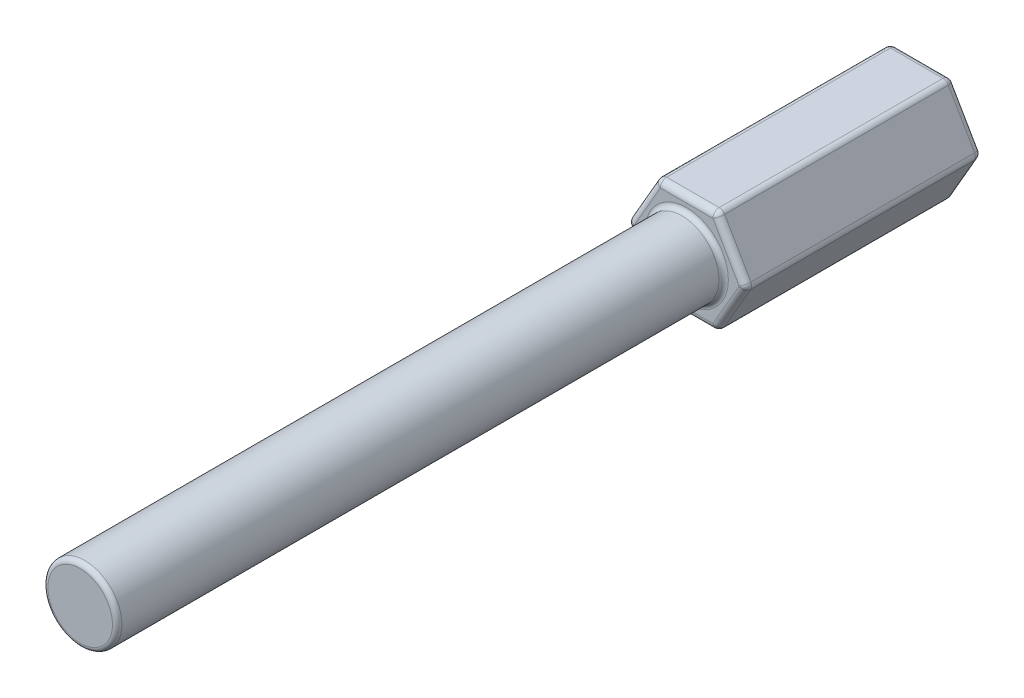
ISO-10303-21;
HEADER;
FILE_DESCRIPTION(('STEP AP214'),'2;1');
FILE_NAME('part.step','',(''),(''),'','','');
FILE_SCHEMA(('AUTOMOTIVE_DESIGN { 1 0 10303 214 1 1 1 1 }'));
ENDSEC;
DATA;
#1=APPLICATION_CONTEXT('core data for automotive mechanical design processes');
#2=APPLICATION_PROTOCOL_DEFINITION('international standard','automotive_design',2000,#1);
#3=PRODUCT_CONTEXT('',#1,'mechanical');
#4=PRODUCT('Part','Part','',(#3));
#5=PRODUCT_RELATED_PRODUCT_CATEGORY('part','',(#4));
#6=PRODUCT_DEFINITION_FORMATION('','',#4);
#7=PRODUCT_DEFINITION_CONTEXT('part definition',#1,'design');
#8=PRODUCT_DEFINITION('design','',#6,#7);
#9=PRODUCT_DEFINITION_SHAPE('','',#8);
#10=(LENGTH_UNIT() NAMED_UNIT(*) SI_UNIT(.MILLI.,.METRE.));
#11=(NAMED_UNIT(*) PLANE_ANGLE_UNIT() SI_UNIT($,.RADIAN.));
#12=(NAMED_UNIT(*) SI_UNIT($,.STERADIAN.) SOLID_ANGLE_UNIT());
#13=UNCERTAINTY_MEASURE_WITH_UNIT(LENGTH_MEASURE(1.E-05),#10,'distance_accuracy_value','');
#14=(GEOMETRIC_REPRESENTATION_CONTEXT(3) GLOBAL_UNCERTAINTY_ASSIGNED_CONTEXT((#13)) GLOBAL_UNIT_ASSIGNED_CONTEXT((#10,
#11,#12)) REPRESENTATION_CONTEXT('',''));
#15=CARTESIAN_POINT('',(0.,0.,0.));
#16=DIRECTION('',(0.,0.,1.));
#17=DIRECTION('',(1.,0.,0.));
#18=AXIS2_PLACEMENT_3D('',#15,#16,#17);
#19=CARTESIAN_POINT('',(-2.41050954265034,-4.175125,19.05));
#20=DIRECTION('',(0.,1.,0.));
#21=DIRECTION('',(-1.,0.,0.));
#22=AXIS2_PLACEMENT_3D('',#19,#20,#21);
#23=PLANE('',#22);
#24=DIRECTION('',(1.,0.,0.));
#25=VECTOR('',#24,1.);
#26=CARTESIAN_POINT('',(-2.41050954265034,-4.175125,0.508000000000002));
#27=LINE('',#26,#25);
#28=CARTESIAN_POINT('',(-2.11721560590201,-4.175125,0.508000000000002));
#29=VERTEX_POINT('',#28);
#30=CARTESIAN_POINT('',(2.11721560590201,-4.175125,0.508000000000002));
#31=VERTEX_POINT('',#30);
#32=EDGE_CURVE('E405',#29,#31,#27,.T.);
#33=ORIENTED_EDGE('',*,*,#32,.T.);
#34=DIRECTION('',(0.,0.,-1.));
#35=VECTOR('',#34,1.);
#36=CARTESIAN_POINT('',(2.11721560590201,-4.175125,19.05));
#37=LINE('',#36,#35);
#38=CARTESIAN_POINT('',(2.11721560590201,-4.175125,18.542));
#39=VERTEX_POINT('',#38);
#40=EDGE_CURVE('E219',#31,#39,#37,.F.);
#41=ORIENTED_EDGE('',*,*,#40,.T.);
#42=DIRECTION('',(1.,0.,0.));
#43=VECTOR('',#42,1.);
#44=CARTESIAN_POINT('',(-2.41050954265034,-4.175125,18.542));
#45=LINE('',#44,#43);
#46=CARTESIAN_POINT('',(-2.11721560590201,-4.175125,18.542));
#47=VERTEX_POINT('',#46);
#48=EDGE_CURVE('E363',#39,#47,#45,.F.);
#49=ORIENTED_EDGE('',*,*,#48,.T.);
#50=DIRECTION('',(0.,0.,-1.));
#51=VECTOR('',#50,1.);
#52=CARTESIAN_POINT('',(-2.11721560590201,-4.175125,19.05));
#53=LINE('',#52,#51);
#54=EDGE_CURVE('E217',#47,#29,#53,.T.);
#55=ORIENTED_EDGE('',*,*,#54,.T.);
#56=EDGE_LOOP('',(#33,#41,#49,#55));
#57=FACE_BOUND('',#56,.T.);
#58=ADVANCED_FACE('F38',(#57),#23,.F.);
#59=CARTESIAN_POINT('',(2.41050954265034,-4.175125,19.05));
#60=DIRECTION('',(-0.866025403784439,0.5,0.));
#61=DIRECTION('',(-0.5,-0.866025403784439,0.));
#62=AXIS2_PLACEMENT_3D('',#59,#60,#61);
#63=PLANE('',#62);
#64=DIRECTION('',(0.5,0.866025403784439,0.));
#65=VECTOR('',#64,1.);
#66=CARTESIAN_POINT('',(2.41050954265034,-4.175125,0.508000000000002));
#67=LINE('',#66,#65);
#68=CARTESIAN_POINT('',(2.5571565110245,-3.921125,0.508000000000002));
#69=VERTEX_POINT('',#68);
#70=CARTESIAN_POINT('',(4.67437211692651,-0.253999999999999,0.508000000000002));
#71=VERTEX_POINT('',#70);
#72=EDGE_CURVE('E195',#69,#71,#67,.T.);
#73=ORIENTED_EDGE('',*,*,#72,.T.);
#74=DIRECTION('',(0.,0.,-1.));
#75=VECTOR('',#74,1.);
#76=CARTESIAN_POINT('',(4.67437211692651,-0.254,19.05));
#77=LINE('',#76,#75);
#78=CARTESIAN_POINT('',(4.67437211692651,-0.253999999999999,18.542));
#79=VERTEX_POINT('',#78);
#80=EDGE_CURVE('E215',#71,#79,#77,.F.);
#81=ORIENTED_EDGE('',*,*,#80,.T.);
#82=DIRECTION('',(0.5,0.866025403784439,0.));
#83=VECTOR('',#82,1.);
#84=CARTESIAN_POINT('',(2.41050954265034,-4.175125,18.542));
#85=LINE('',#84,#83);
#86=CARTESIAN_POINT('',(2.5571565110245,-3.921125,18.542));
#87=VERTEX_POINT('',#86);
#88=EDGE_CURVE('E380',#79,#87,#85,.F.);
#89=ORIENTED_EDGE('',*,*,#88,.T.);
#90=DIRECTION('',(0.,0.,-1.));
#91=VECTOR('',#90,1.);
#92=CARTESIAN_POINT('',(2.5571565110245,-3.921125,19.05));
#93=LINE('',#92,#91);
#94=EDGE_CURVE('E213',#87,#69,#93,.T.);
#95=ORIENTED_EDGE('',*,*,#94,.T.);
#96=EDGE_LOOP('',(#73,#81,#89,#95));
#97=FACE_BOUND('',#96,.T.);
#98=ADVANCED_FACE('F382',(#97),#63,.F.);
#99=CARTESIAN_POINT('',(4.82101908530067,0.,19.05));
#100=DIRECTION('',(-0.866025403784439,-0.5,0.));
#101=DIRECTION('',(0.5,-0.866025403784439,0.));
#102=AXIS2_PLACEMENT_3D('',#99,#100,#101);
#103=PLANE('',#102);
#104=DIRECTION('',(-0.5,0.866025403784439,0.));
#105=VECTOR('',#104,1.);
#106=CARTESIAN_POINT('',(4.82101908530067,0.,0.508000000000002));
#107=LINE('',#106,#105);
#108=CARTESIAN_POINT('',(4.67437211692651,0.254,0.508000000000002));
#109=VERTEX_POINT('',#108);
#110=CARTESIAN_POINT('',(2.5571565110245,3.921125,0.508000000000002));
#111=VERTEX_POINT('',#110);
#112=EDGE_CURVE('E401',#109,#111,#107,.T.);
#113=ORIENTED_EDGE('',*,*,#112,.T.);
#114=DIRECTION('',(0.,0.,-1.));
#115=VECTOR('',#114,1.);
#116=CARTESIAN_POINT('',(2.5571565110245,3.921125,19.05));
#117=LINE('',#116,#115);
#118=CARTESIAN_POINT('',(2.5571565110245,3.921125,18.542));
#119=VERTEX_POINT('',#118);
#120=EDGE_CURVE('E211',#111,#119,#117,.F.);
#121=ORIENTED_EDGE('',*,*,#120,.T.);
#122=DIRECTION('',(-0.5,0.866025403784439,0.));
#123=VECTOR('',#122,1.);
#124=CARTESIAN_POINT('',(4.82101908530067,0.,18.542));
#125=LINE('',#124,#123);
#126=CARTESIAN_POINT('',(4.67437211692651,0.254,18.542));
#127=VERTEX_POINT('',#126);
#128=EDGE_CURVE('E398',#119,#127,#125,.F.);
#129=ORIENTED_EDGE('',*,*,#128,.T.);
#130=DIRECTION('',(0.,0.,-1.));
#131=VECTOR('',#130,1.);
#132=CARTESIAN_POINT('',(4.67437211692651,0.254,19.05));
#133=LINE('',#132,#131);
#134=EDGE_CURVE('E209',#127,#109,#133,.T.);
#135=ORIENTED_EDGE('',*,*,#134,.T.);
#136=EDGE_LOOP('',(#113,#121,#129,#135));
#137=FACE_BOUND('',#136,.T.);
#138=ADVANCED_FACE('F449',(#137),#103,.F.);
#139=CARTESIAN_POINT('',(2.41050954265034,4.175125,19.05));
#140=DIRECTION('',(0.,-1.,0.));
#141=DIRECTION('',(1.,0.,0.));
#142=AXIS2_PLACEMENT_3D('',#139,#140,#141);
#143=PLANE('',#142);
#144=DIRECTION('',(-1.,0.,0.));
#145=VECTOR('',#144,1.);
#146=CARTESIAN_POINT('',(2.41050954265034,4.175125,18.542));
#147=LINE('',#146,#145);
#148=CARTESIAN_POINT('',(-2.11721560590201,4.175125,18.542));
#149=VERTEX_POINT('',#148);
#150=CARTESIAN_POINT('',(2.11721560590201,4.175125,18.542));
#151=VERTEX_POINT('',#150);
#152=EDGE_CURVE('E408',#149,#151,#147,.F.);
#153=ORIENTED_EDGE('',*,*,#152,.T.);
#154=DIRECTION('',(0.,0.,-1.));
#155=VECTOR('',#154,1.);
#156=CARTESIAN_POINT('',(2.11721560590201,4.175125,19.05));
#157=LINE('',#156,#155);
#158=CARTESIAN_POINT('',(2.11721560590201,4.175125,0.508000000000002));
#159=VERTEX_POINT('',#158);
#160=EDGE_CURVE('E207',#151,#159,#157,.T.);
#161=ORIENTED_EDGE('',*,*,#160,.T.);
#162=DIRECTION('',(-1.,0.,0.));
#163=VECTOR('',#162,1.);
#164=CARTESIAN_POINT('',(2.41050954265034,4.175125,0.508000000000002));
#165=LINE('',#164,#163);
#166=CARTESIAN_POINT('',(-2.11721560590201,4.175125,0.508000000000002));
#167=VERTEX_POINT('',#166);
#168=EDGE_CURVE('E411',#159,#167,#165,.T.);
#169=ORIENTED_EDGE('',*,*,#168,.T.);
#170=DIRECTION('',(0.,0.,-1.));
#171=VECTOR('',#170,1.);
#172=CARTESIAN_POINT('',(-2.11721560590201,4.175125,19.05));
#173=LINE('',#172,#171);
#174=EDGE_CURVE('E200',#167,#149,#173,.F.);
#175=ORIENTED_EDGE('',*,*,#174,.T.);
#176=EDGE_LOOP('',(#153,#161,#169,#175));
#177=FACE_BOUND('',#176,.T.);
#178=ADVANCED_FACE('F416',(#177),#143,.F.);
#179=CARTESIAN_POINT('',(-2.41050954265034,4.175125,19.05));
#180=DIRECTION('',(0.866025403784439,-0.5,0.));
#181=DIRECTION('',(0.5,0.866025403784439,0.));
#182=AXIS2_PLACEMENT_3D('',#179,#180,#181);
#183=PLANE('',#182);
#184=DIRECTION('',(-0.5,-0.866025403784439,0.));
#185=VECTOR('',#184,1.);
#186=CARTESIAN_POINT('',(-2.41050954265034,4.175125,18.542));
#187=LINE('',#186,#185);
#188=CARTESIAN_POINT('',(-4.67437211692651,0.254000000000002,18.542));
#189=VERTEX_POINT('',#188);
#190=CARTESIAN_POINT('',(-2.5571565110245,3.921125,18.542));
#191=VERTEX_POINT('',#190);
#192=EDGE_CURVE('E263',#189,#191,#187,.F.);
#193=ORIENTED_EDGE('',*,*,#192,.T.);
#194=DIRECTION('',(0.,0.,-1.));
#195=VECTOR('',#194,1.);
#196=CARTESIAN_POINT('',(-2.5571565110245,3.921125,19.05));
#197=LINE('',#196,#195);
#198=CARTESIAN_POINT('',(-2.5571565110245,3.921125,0.508000000000002));
#199=VERTEX_POINT('',#198);
#200=EDGE_CURVE('E11',#191,#199,#197,.T.);
#201=ORIENTED_EDGE('',*,*,#200,.T.);
#202=DIRECTION('',(-0.5,-0.866025403784439,0.));
#203=VECTOR('',#202,1.);
#204=CARTESIAN_POINT('',(-2.41050954265034,4.175125,0.508000000000002));
#205=LINE('',#204,#203);
#206=CARTESIAN_POINT('',(-4.67437211692651,0.254000000000002,0.508000000000002));
#207=VERTEX_POINT('',#206);
#208=EDGE_CURVE('E264',#199,#207,#205,.T.);
#209=ORIENTED_EDGE('',*,*,#208,.T.);
#210=DIRECTION('',(0.,0.,-1.));
#211=VECTOR('',#210,1.);
#212=CARTESIAN_POINT('',(-4.67437211692651,0.254000000000002,19.05));
#213=LINE('',#212,#211);
#214=EDGE_CURVE('E47',#207,#189,#213,.F.);
#215=ORIENTED_EDGE('',*,*,#214,.T.);
#216=EDGE_LOOP('',(#193,#201,#209,#215));
#217=FACE_BOUND('',#216,.T.);
#218=ADVANCED_FACE('F262',(#217),#183,.F.);
#219=CARTESIAN_POINT('',(-4.82101908530067,0.,19.05));
#220=DIRECTION('',(0.866025403784439,0.5,0.));
#221=DIRECTION('',(-0.5,0.866025403784439,0.));
#222=AXIS2_PLACEMENT_3D('',#219,#220,#221);
#223=PLANE('',#222);
#224=DIRECTION('',(0.5,-0.866025403784439,0.));
#225=VECTOR('',#224,1.);
#226=CARTESIAN_POINT('',(-4.82101908530067,0.,0.508000000000002));
#227=LINE('',#226,#225);
#228=CARTESIAN_POINT('',(-4.67437211692651,-0.253999999999998,0.508000000000002));
#229=VERTEX_POINT('',#228);
#230=CARTESIAN_POINT('',(-2.5571565110245,-3.921125,0.508000000000002));
#231=VERTEX_POINT('',#230);
#232=EDGE_CURVE('E172',#229,#231,#227,.T.);
#233=ORIENTED_EDGE('',*,*,#232,.T.);
#234=DIRECTION('',(0.,0.,-1.));
#235=VECTOR('',#234,1.);
#236=CARTESIAN_POINT('',(-2.5571565110245,-3.921125,19.05));
#237=LINE('',#236,#235);
#238=CARTESIAN_POINT('',(-2.5571565110245,-3.921125,18.542));
#239=VERTEX_POINT('',#238);
#240=EDGE_CURVE('E223',#231,#239,#237,.F.);
#241=ORIENTED_EDGE('',*,*,#240,.T.);
#242=DIRECTION('',(0.5,-0.866025403784439,0.));
#243=VECTOR('',#242,1.);
#244=CARTESIAN_POINT('',(-4.82101908530067,0.,18.542));
#245=LINE('',#244,#243);
#246=CARTESIAN_POINT('',(-4.67437211692651,-0.253999999999998,18.542));
#247=VERTEX_POINT('',#246);
#248=EDGE_CURVE('E273',#239,#247,#245,.F.);
#249=ORIENTED_EDGE('',*,*,#248,.T.);
#250=DIRECTION('',(0.,0.,-1.));
#251=VECTOR('',#250,1.);
#252=CARTESIAN_POINT('',(-4.67437211692651,-0.253999999999998,19.05));
#253=LINE('',#252,#251);
#254=EDGE_CURVE('E221',#247,#229,#253,.T.);
#255=ORIENTED_EDGE('',*,*,#254,.T.);
#256=EDGE_LOOP('',(#233,#241,#249,#255));
#257=FACE_BOUND('',#256,.T.);
#258=ADVANCED_FACE('F337',(#257),#223,.F.);
#259=CARTESIAN_POINT('',(0.,0.,19.05));
#260=DIRECTION('',(0.,0.,1.));
#261=DIRECTION('',(1.,0.,0.));
#262=AXIS2_PLACEMENT_3D('',#259,#260,#261);
#263=PLANE('',#262);
#264=DIRECTION('',(1.,0.,0.));
#265=VECTOR('',#264,1.);
#266=CARTESIAN_POINT('',(2.41050954265034,-3.667125,19.05));
#267=LINE('',#266,#265);
#268=CARTESIAN_POINT('',(-2.11721560590201,-3.667125,19.05));
#269=VERTEX_POINT('',#268);
#270=CARTESIAN_POINT('',(2.11721560590201,-3.667125,19.05));
#271=VERTEX_POINT('',#270);
#272=EDGE_CURVE('E284',#269,#271,#267,.T.);
#273=ORIENTED_EDGE('',*,*,#272,.T.);
#274=DIRECTION('',(0.5,0.866025403784439,0.));
#275=VECTOR('',#274,1.);
#276=CARTESIAN_POINT('',(4.38107818017818,0.254000000000001,19.05));
#277=LINE('',#276,#275);
#278=CARTESIAN_POINT('',(4.23443121180401,0.,19.05));
#279=VERTEX_POINT('',#278);
#280=EDGE_CURVE('E290',#271,#279,#277,.T.);
#281=ORIENTED_EDGE('',*,*,#280,.T.);
#282=DIRECTION('',(-0.5,0.866025403784439,0.));
#283=VECTOR('',#282,1.);
#284=CARTESIAN_POINT('',(1.97056863752784,3.921125,19.05));
#285=LINE('',#284,#283);
#286=CARTESIAN_POINT('',(2.11721560590201,3.667125,19.05));
#287=VERTEX_POINT('',#286);
#288=EDGE_CURVE('E287',#279,#287,#285,.T.);
#289=ORIENTED_EDGE('',*,*,#288,.T.);
#290=DIRECTION('',(-1.,0.,0.));
#291=VECTOR('',#290,1.);
#292=CARTESIAN_POINT('',(-2.41050954265034,3.667125,19.05));
#293=LINE('',#292,#291);
#294=CARTESIAN_POINT('',(-2.11721560590201,3.667125,19.05));
#295=VERTEX_POINT('',#294);
#296=EDGE_CURVE('E281',#287,#295,#293,.T.);
#297=ORIENTED_EDGE('',*,*,#296,.T.);
#298=DIRECTION('',(-0.5,-0.866025403784439,0.));
#299=VECTOR('',#298,1.);
#300=CARTESIAN_POINT('',(-4.38107818017818,-0.253999999999998,19.05));
#301=LINE('',#300,#299);
#302=CARTESIAN_POINT('',(-4.23443121180401,0.,19.05));
#303=VERTEX_POINT('',#302);
#304=EDGE_CURVE('E279',#295,#303,#301,.T.);
#305=ORIENTED_EDGE('',*,*,#304,.T.);
#306=DIRECTION('',(0.5,-0.866025403784439,0.));
#307=VECTOR('',#306,1.);
#308=CARTESIAN_POINT('',(-1.97056863752784,-3.921125,19.05));
#309=LINE('',#308,#307);
#310=EDGE_CURVE('E271',#303,#269,#309,.T.);
#311=ORIENTED_EDGE('',*,*,#310,.T.);
#312=EDGE_LOOP('',(#273,#281,#289,#297,#305,#311));
#313=FACE_BOUND('',#312,.T.);
#314=CARTESIAN_POINT('',(0.,0.,19.05));
#315=DIRECTION('',(0.,0.,1.));
#316=DIRECTION('',(1.,0.,0.));
#317=AXIS2_PLACEMENT_3D('',#314,#315,#316);
#318=CIRCLE('',#317,3.3655);
#319=CARTESIAN_POINT('',(3.3655,0.,19.05));
#320=VERTEX_POINT('',#319);
#321=EDGE_CURVE('E384',#320,#320,#318,.F.);
#322=ORIENTED_EDGE('',*,*,#321,.T.);
#323=EDGE_LOOP('',(#322));
#324=FACE_BOUND('',#323,.T.);
#325=ADVANCED_FACE('F355',(#313,#324),#263,.T.);
#326=CARTESIAN_POINT('',(0.,0.,0.));
#327=DIRECTION('',(0.,0.,1.));
#328=DIRECTION('',(1.,0.,0.));
#329=AXIS2_PLACEMENT_3D('',#326,#327,#328);
#330=PLANE('',#329);
#331=DIRECTION('',(-0.5,0.866025403784439,0.));
#332=VECTOR('',#331,1.);
#333=CARTESIAN_POINT('',(3.17582340885301,1.8335625,0.));
#334=LINE('',#333,#332);
#335=CARTESIAN_POINT('',(2.11721560590201,3.667125,0.));
#336=VERTEX_POINT('',#335);
#337=CARTESIAN_POINT('',(4.23443121180401,0.,0.));
#338=VERTEX_POINT('',#337);
#339=EDGE_CURVE('E394',#336,#338,#334,.F.);
#340=ORIENTED_EDGE('',*,*,#339,.T.);
#341=DIRECTION('',(0.5,0.866025403784439,0.));
#342=VECTOR('',#341,1.);
#343=CARTESIAN_POINT('',(3.17582340885301,-1.8335625,0.));
#344=LINE('',#343,#342);
#345=CARTESIAN_POINT('',(2.11721560590201,-3.667125,0.));
#346=VERTEX_POINT('',#345);
#347=EDGE_CURVE('E396',#338,#346,#344,.F.);
#348=ORIENTED_EDGE('',*,*,#347,.T.);
#349=DIRECTION('',(1.,0.,0.));
#350=VECTOR('',#349,1.);
#351=CARTESIAN_POINT('',(0.,-3.667125,0.));
#352=LINE('',#351,#350);
#353=CARTESIAN_POINT('',(-2.11721560590201,-3.667125,0.));
#354=VERTEX_POINT('',#353);
#355=EDGE_CURVE('E189',#346,#354,#352,.F.);
#356=ORIENTED_EDGE('',*,*,#355,.T.);
#357=DIRECTION('',(0.5,-0.866025403784439,0.));
#358=VECTOR('',#357,1.);
#359=CARTESIAN_POINT('',(-3.17582340885301,-1.8335625,0.));
#360=LINE('',#359,#358);
#361=CARTESIAN_POINT('',(-4.23443121180401,0.,0.));
#362=VERTEX_POINT('',#361);
#363=EDGE_CURVE('E169',#354,#362,#360,.F.);
#364=ORIENTED_EDGE('',*,*,#363,.T.);
#365=DIRECTION('',(-0.5,-0.866025403784439,0.));
#366=VECTOR('',#365,1.);
#367=CARTESIAN_POINT('',(-3.17582340885301,1.8335625,0.));
#368=LINE('',#367,#366);
#369=CARTESIAN_POINT('',(-2.11721560590201,3.667125,0.));
#370=VERTEX_POINT('',#369);
#371=EDGE_CURVE('E185',#362,#370,#368,.F.);
#372=ORIENTED_EDGE('',*,*,#371,.T.);
#373=DIRECTION('',(-1.,0.,0.));
#374=VECTOR('',#373,1.);
#375=CARTESIAN_POINT('',(0.,3.667125,0.));
#376=LINE('',#375,#374);
#377=EDGE_CURVE('E190',#370,#336,#376,.F.);
#378=ORIENTED_EDGE('',*,*,#377,.T.);
#379=EDGE_LOOP('',(#340,#348,#356,#364,#372,#378));
#380=FACE_BOUND('',#379,.T.);
#381=ADVANCED_FACE('F183',(#380),#330,.F.);
#382=CARTESIAN_POINT('',(0.,0.,67.945));
#383=DIRECTION('',(0.,0.,-1.));
#384=DIRECTION('',(-1.,0.,0.));
#385=AXIS2_PLACEMENT_3D('',#382,#383,#384);
#386=CYLINDRICAL_SURFACE('',#385,2.9845);
#387=CARTESIAN_POINT('',(0.,0.,19.431));
#388=DIRECTION('',(0.,0.,1.));
#389=DIRECTION('',(1.,0.,0.));
#390=AXIS2_PLACEMENT_3D('',#387,#388,#389);
#391=CIRCLE('',#390,2.9845);
#392=CARTESIAN_POINT('',(2.9845,0.,19.431));
#393=VERTEX_POINT('',#392);
#394=EDGE_CURVE('E388',#393,#393,#391,.T.);
#395=ORIENTED_EDGE('',*,*,#394,.T.);
#396=EDGE_LOOP('',(#395));
#397=FACE_BOUND('',#396,.T.);
#398=CARTESIAN_POINT('',(0.,0.,67.564));
#399=DIRECTION('',(0.,0.,1.));
#400=DIRECTION('',(1.,0.,0.));
#401=AXIS2_PLACEMENT_3D('',#398,#399,#400);
#402=CIRCLE('',#401,2.9845);
#403=CARTESIAN_POINT('',(2.9845,0.,67.564));
#404=VERTEX_POINT('',#403);
#405=EDGE_CURVE('E849',#404,#404,#402,.F.);
#406=ORIENTED_EDGE('',*,*,#405,.T.);
#407=EDGE_LOOP('',(#406));
#408=FACE_BOUND('',#407,.T.);
#409=ADVANCED_FACE('F680',(#397,#408),#386,.T.);
#410=CARTESIAN_POINT('',(0.,0.,67.945));
#411=DIRECTION('',(0.,0.,1.));
#412=DIRECTION('',(1.,0.,0.));
#413=AXIS2_PLACEMENT_3D('',#410,#411,#412);
#414=PLANE('',#413);
#415=CARTESIAN_POINT('',(0.,0.,67.945));
#416=DIRECTION('',(0.,0.,1.));
#417=DIRECTION('',(1.,0.,0.));
#418=AXIS2_PLACEMENT_3D('',#415,#416,#417);
#419=CIRCLE('',#418,2.6035);
#420=CARTESIAN_POINT('',(2.6035,0.,67.945));
#421=VERTEX_POINT('',#420);
#422=EDGE_CURVE('E233',#421,#421,#419,.T.);
#423=ORIENTED_EDGE('',*,*,#422,.T.);
#424=EDGE_LOOP('',(#423));
#425=FACE_BOUND('',#424,.T.);
#426=ADVANCED_FACE('F482',(#425),#414,.T.);
#427=CARTESIAN_POINT('',(0.,0.,67.564));
#428=DIRECTION('',(0.,0.,1.));
#429=DIRECTION('',(1.,0.,0.));
#430=AXIS2_PLACEMENT_3D('',#427,#428,#429);
#431=TOROIDAL_SURFACE('',#430,2.6035,0.381);
#432=ORIENTED_EDGE('',*,*,#405,.F.);
#433=EDGE_LOOP('',(#432));
#434=FACE_BOUND('',#433,.T.);
#435=ORIENTED_EDGE('',*,*,#422,.F.);
#436=EDGE_LOOP('',(#435));
#437=FACE_BOUND('',#436,.T.);
#438=ADVANCED_FACE('F478',(#434,#437),#431,.T.);
#439=CARTESIAN_POINT('',(0.,0.,19.431));
#440=DIRECTION('',(0.,0.,1.));
#441=DIRECTION('',(1.,0.,0.));
#442=AXIS2_PLACEMENT_3D('',#439,#440,#441);
#443=TOROIDAL_SURFACE('',#442,3.3655,0.381);
#444=ORIENTED_EDGE('',*,*,#321,.F.);
#445=EDGE_LOOP('',(#444));
#446=FACE_BOUND('',#445,.T.);
#447=ORIENTED_EDGE('',*,*,#394,.F.);
#448=EDGE_LOOP('',(#447));
#449=FACE_BOUND('',#448,.T.);
#450=ADVANCED_FACE('F481',(#446,#449),#443,.F.);
#451=CARTESIAN_POINT('',(-1.97056863752784,3.921125,0.508000000000002));
#452=DIRECTION('',(-0.5,-0.866025403784439,0.));
#453=DIRECTION('',(0.866025403784439,-0.5,0.));
#454=AXIS2_PLACEMENT_3D('',#451,#452,#453);
#455=CYLINDRICAL_SURFACE('',#454,0.508);
#456=ORIENTED_EDGE('',*,*,#208,.F.);
#457=CARTESIAN_POINT('',(-2.11721560590201,3.667125,0.508000000000002));
#458=DIRECTION('',(-0.5,-0.866025403784439,0.));
#459=DIRECTION('',(0.866025403784439,-0.5,0.));
#460=AXIS2_PLACEMENT_3D('',#457,#458,#459);
#461=CIRCLE('',#460,0.508);
#462=EDGE_CURVE('E194',#199,#370,#461,.T.);
#463=ORIENTED_EDGE('',*,*,#462,.T.);
#464=ORIENTED_EDGE('',*,*,#371,.F.);
#465=CARTESIAN_POINT('',(-4.23443121180401,0.,0.508000000000002));
#466=DIRECTION('',(-0.5,-0.866025403784439,0.));
#467=DIRECTION('',(0.866025403784439,-0.5,0.));
#468=AXIS2_PLACEMENT_3D('',#465,#466,#467);
#469=CIRCLE('',#468,0.508);
#470=EDGE_CURVE('E55',#362,#207,#469,.F.);
#471=ORIENTED_EDGE('',*,*,#470,.T.);
#472=EDGE_LOOP('',(#456,#463,#464,#471));
#473=FACE_BOUND('',#472,.T.);
#474=ADVANCED_FACE('F192',(#473),#455,.T.);
#475=CARTESIAN_POINT('',(-4.38107818017818,0.254000000000002,0.508000000000002));
#476=DIRECTION('',(0.5,-0.866025403784439,0.));
#477=DIRECTION('',(0.866025403784439,0.5,0.));
#478=AXIS2_PLACEMENT_3D('',#475,#476,#477);
#479=CYLINDRICAL_SURFACE('',#478,0.508);
#480=ORIENTED_EDGE('',*,*,#363,.F.);
#481=CARTESIAN_POINT('',(-2.11721560590201,-3.667125,0.508000000000002));
#482=DIRECTION('',(0.5,-0.866025403784439,0.));
#483=DIRECTION('',(0.866025403784439,0.5,0.));
#484=AXIS2_PLACEMENT_3D('',#481,#482,#483);
#485=CIRCLE('',#484,0.508);
#486=EDGE_CURVE('E176',#354,#231,#485,.F.);
#487=ORIENTED_EDGE('',*,*,#486,.T.);
#488=ORIENTED_EDGE('',*,*,#232,.F.);
#489=CARTESIAN_POINT('',(-4.23443121180401,0.,0.508000000000002));
#490=DIRECTION('',(0.5,-0.866025403784439,0.));
#491=DIRECTION('',(0.866025403784439,0.5,0.));
#492=AXIS2_PLACEMENT_3D('',#489,#490,#491);
#493=CIRCLE('',#492,0.508);
#494=EDGE_CURVE('E166',#229,#362,#493,.T.);
#495=ORIENTED_EDGE('',*,*,#494,.T.);
#496=EDGE_LOOP('',(#480,#487,#488,#495));
#497=FACE_BOUND('',#496,.T.);
#498=ADVANCED_FACE('F168',(#497),#479,.T.);
#499=CARTESIAN_POINT('',(2.41050954265034,3.667125,0.508000000000002));
#500=DIRECTION('',(-1.,0.,0.));
#501=DIRECTION('',(0.,-1.,0.));
#502=AXIS2_PLACEMENT_3D('',#499,#500,#501);
#503=CYLINDRICAL_SURFACE('',#502,0.508);
#504=ORIENTED_EDGE('',*,*,#168,.F.);
#505=CARTESIAN_POINT('',(2.11721560590201,3.667125,0.508000000000002));
#506=DIRECTION('',(-1.,0.,0.));
#507=DIRECTION('',(0.,-1.,0.));
#508=AXIS2_PLACEMENT_3D('',#505,#506,#507);
#509=CIRCLE('',#508,0.508);
#510=EDGE_CURVE('E310',#159,#336,#509,.T.);
#511=ORIENTED_EDGE('',*,*,#510,.T.);
#512=ORIENTED_EDGE('',*,*,#377,.F.);
#513=CARTESIAN_POINT('',(-2.11721560590201,3.667125,0.508000000000002));
#514=DIRECTION('',(-1.,0.,0.));
#515=DIRECTION('',(0.,-1.,0.));
#516=AXIS2_PLACEMENT_3D('',#513,#514,#515);
#517=CIRCLE('',#516,0.508);
#518=EDGE_CURVE('E308',#370,#167,#517,.F.);
#519=ORIENTED_EDGE('',*,*,#518,.T.);
#520=EDGE_LOOP('',(#504,#511,#512,#519));
#521=FACE_BOUND('',#520,.T.);
#522=ADVANCED_FACE('F493',(#521),#503,.T.);
#523=CARTESIAN_POINT('',(-2.41050954265034,-3.667125,0.508000000000002));
#524=DIRECTION('',(1.,0.,0.));
#525=DIRECTION('',(0.,1.,0.));
#526=AXIS2_PLACEMENT_3D('',#523,#524,#525);
#527=CYLINDRICAL_SURFACE('',#526,0.508);
#528=ORIENTED_EDGE('',*,*,#355,.F.);
#529=CARTESIAN_POINT('',(2.11721560590201,-3.667125,0.508000000000002));
#530=DIRECTION('',(1.,0.,0.));
#531=DIRECTION('',(0.,1.,0.));
#532=AXIS2_PLACEMENT_3D('',#529,#530,#531);
#533=CIRCLE('',#532,0.508);
#534=EDGE_CURVE('E328',#346,#31,#533,.F.);
#535=ORIENTED_EDGE('',*,*,#534,.T.);
#536=ORIENTED_EDGE('',*,*,#32,.F.);
#537=CARTESIAN_POINT('',(-2.11721560590201,-3.667125,0.508000000000002));
#538=DIRECTION('',(1.,0.,0.));
#539=DIRECTION('',(0.,1.,0.));
#540=AXIS2_PLACEMENT_3D('',#537,#538,#539);
#541=CIRCLE('',#540,0.508);
#542=EDGE_CURVE('E326',#29,#354,#541,.T.);
#543=ORIENTED_EDGE('',*,*,#542,.T.);
#544=EDGE_LOOP('',(#528,#535,#536,#543));
#545=FACE_BOUND('',#544,.T.);
#546=ADVANCED_FACE('F468',(#545),#527,.T.);
#547=CARTESIAN_POINT('',(4.38107818017818,-0.254,0.508000000000002));
#548=DIRECTION('',(-0.5,0.866025403784439,0.));
#549=DIRECTION('',(-0.866025403784439,-0.5,0.));
#550=AXIS2_PLACEMENT_3D('',#547,#548,#549);
#551=CYLINDRICAL_SURFACE('',#550,0.508);
#552=ORIENTED_EDGE('',*,*,#339,.F.);
#553=CARTESIAN_POINT('',(2.11721560590201,3.667125,0.508000000000002));
#554=DIRECTION('',(-0.5,0.866025403784439,0.));
#555=DIRECTION('',(-0.866025403784439,-0.5,0.));
#556=AXIS2_PLACEMENT_3D('',#553,#554,#555);
#557=CIRCLE('',#556,0.508);
#558=EDGE_CURVE('E306',#336,#111,#557,.F.);
#559=ORIENTED_EDGE('',*,*,#558,.T.);
#560=ORIENTED_EDGE('',*,*,#112,.F.);
#561=CARTESIAN_POINT('',(4.23443121180401,0.,0.508000000000002));
#562=DIRECTION('',(-0.5,0.866025403784439,0.));
#563=DIRECTION('',(-0.866025403784439,-0.5,0.));
#564=AXIS2_PLACEMENT_3D('',#561,#562,#563);
#565=CIRCLE('',#564,0.508);
#566=EDGE_CURVE('E304',#109,#338,#565,.T.);
#567=ORIENTED_EDGE('',*,*,#566,.T.);
#568=EDGE_LOOP('',(#552,#559,#560,#567));
#569=FACE_BOUND('',#568,.T.);
#570=ADVANCED_FACE('F454',(#569),#551,.T.);
#571=CARTESIAN_POINT('',(1.97056863752784,-3.921125,0.508000000000002));
#572=DIRECTION('',(0.5,0.866025403784439,0.));
#573=DIRECTION('',(-0.866025403784439,0.5,0.));
#574=AXIS2_PLACEMENT_3D('',#571,#572,#573);
#575=CYLINDRICAL_SURFACE('',#574,0.508);
#576=ORIENTED_EDGE('',*,*,#347,.F.);
#577=CARTESIAN_POINT('',(4.23443121180401,0.,0.508000000000002));
#578=DIRECTION('',(0.5,0.866025403784439,0.));
#579=DIRECTION('',(-0.866025403784439,0.5,0.));
#580=AXIS2_PLACEMENT_3D('',#577,#578,#579);
#581=CIRCLE('',#580,0.508);
#582=EDGE_CURVE('E319',#338,#71,#581,.F.);
#583=ORIENTED_EDGE('',*,*,#582,.T.);
#584=ORIENTED_EDGE('',*,*,#72,.F.);
#585=CARTESIAN_POINT('',(2.11721560590201,-3.667125,0.508000000000002));
#586=DIRECTION('',(0.5,0.866025403784439,0.));
#587=DIRECTION('',(-0.866025403784439,0.5,0.));
#588=AXIS2_PLACEMENT_3D('',#585,#586,#587);
#589=CIRCLE('',#588,0.508);
#590=EDGE_CURVE('E317',#69,#346,#589,.T.);
#591=ORIENTED_EDGE('',*,*,#590,.T.);
#592=EDGE_LOOP('',(#576,#583,#584,#591));
#593=FACE_BOUND('',#592,.T.);
#594=ADVANCED_FACE('F461',(#593),#575,.T.);
#595=CARTESIAN_POINT('',(-3.17582340885301,-1.8335625,18.542));
#596=DIRECTION('',(-0.5,0.866025403784439,0.));
#597=DIRECTION('',(-0.866025403784439,-0.5,0.));
#598=AXIS2_PLACEMENT_3D('',#595,#596,#597);
#599=CYLINDRICAL_SURFACE('',#598,0.508);
#600=ORIENTED_EDGE('',*,*,#248,.F.);
#601=CARTESIAN_POINT('',(-2.11721560590201,-3.667125,18.542));
#602=DIRECTION('',(-0.5,0.866025403784439,0.));
#603=DIRECTION('',(-0.866025403784439,-0.5,0.));
#604=AXIS2_PLACEMENT_3D('',#601,#602,#603);
#605=CIRCLE('',#604,0.508);
#606=EDGE_CURVE('E177',#239,#269,#605,.T.);
#607=ORIENTED_EDGE('',*,*,#606,.T.);
#608=ORIENTED_EDGE('',*,*,#310,.F.);
#609=CARTESIAN_POINT('',(-4.23443121180401,0.,18.542));
#610=DIRECTION('',(-0.5,0.866025403784439,0.));
#611=DIRECTION('',(-0.866025403784439,-0.5,0.));
#612=AXIS2_PLACEMENT_3D('',#609,#610,#611);
#613=CIRCLE('',#612,0.508);
#614=EDGE_CURVE('E330',#303,#247,#613,.F.);
#615=ORIENTED_EDGE('',*,*,#614,.T.);
#616=EDGE_LOOP('',(#600,#607,#608,#615));
#617=FACE_BOUND('',#616,.T.);
#618=ADVANCED_FACE('F352',(#617),#599,.T.);
#619=CARTESIAN_POINT('',(0.,-3.667125,18.542));
#620=DIRECTION('',(-1.,0.,0.));
#621=DIRECTION('',(0.,-1.,0.));
#622=AXIS2_PLACEMENT_3D('',#619,#620,#621);
#623=CYLINDRICAL_SURFACE('',#622,0.508);
#624=ORIENTED_EDGE('',*,*,#48,.F.);
#625=CARTESIAN_POINT('',(2.11721560590201,-3.667125,18.542));
#626=DIRECTION('',(-1.,0.,0.));
#627=DIRECTION('',(0.,-1.,0.));
#628=AXIS2_PLACEMENT_3D('',#625,#626,#627);
#629=CIRCLE('',#628,0.508);
#630=EDGE_CURVE('E324',#39,#271,#629,.T.);
#631=ORIENTED_EDGE('',*,*,#630,.T.);
#632=ORIENTED_EDGE('',*,*,#272,.F.);
#633=CARTESIAN_POINT('',(-2.11721560590201,-3.667125,18.542));
#634=DIRECTION('',(-1.,0.,0.));
#635=DIRECTION('',(0.,-1.,0.));
#636=AXIS2_PLACEMENT_3D('',#633,#634,#635);
#637=CIRCLE('',#636,0.508);
#638=EDGE_CURVE('E321',#269,#47,#637,.F.);
#639=ORIENTED_EDGE('',*,*,#638,.T.);
#640=EDGE_LOOP('',(#624,#631,#632,#639));
#641=FACE_BOUND('',#640,.T.);
#642=ADVANCED_FACE('F360',(#641),#623,.T.);
#643=CARTESIAN_POINT('',(-3.17582340885301,1.8335625,18.542));
#644=DIRECTION('',(0.5,0.866025403784439,0.));
#645=DIRECTION('',(-0.866025403784439,0.5,0.));
#646=AXIS2_PLACEMENT_3D('',#643,#644,#645);
#647=CYLINDRICAL_SURFACE('',#646,0.508);
#648=ORIENTED_EDGE('',*,*,#304,.F.);
#649=CARTESIAN_POINT('',(-2.11721560590201,3.667125,18.542));
#650=DIRECTION('',(0.5,0.866025403784439,0.));
#651=DIRECTION('',(-0.866025403784439,0.5,0.));
#652=AXIS2_PLACEMENT_3D('',#649,#650,#651);
#653=CIRCLE('',#652,0.508);
#654=EDGE_CURVE('E198',#295,#191,#653,.F.);
#655=ORIENTED_EDGE('',*,*,#654,.T.);
#656=ORIENTED_EDGE('',*,*,#192,.F.);
#657=CARTESIAN_POINT('',(-4.23443121180401,0.,18.542));
#658=DIRECTION('',(0.5,0.866025403784439,0.));
#659=DIRECTION('',(-0.866025403784439,0.5,0.));
#660=AXIS2_PLACEMENT_3D('',#657,#658,#659);
#661=CIRCLE('',#660,0.508);
#662=EDGE_CURVE('E202',#189,#303,#661,.T.);
#663=ORIENTED_EDGE('',*,*,#662,.T.);
#664=EDGE_LOOP('',(#648,#655,#656,#663));
#665=FACE_BOUND('',#664,.T.);
#666=ADVANCED_FACE('F268',(#665),#647,.T.);
#667=CARTESIAN_POINT('',(3.17582340885301,-1.8335625,18.542));
#668=DIRECTION('',(-0.5,-0.866025403784439,0.));
#669=DIRECTION('',(0.866025403784439,-0.5,0.));
#670=AXIS2_PLACEMENT_3D('',#667,#668,#669);
#671=CYLINDRICAL_SURFACE('',#670,0.508);
#672=ORIENTED_EDGE('',*,*,#88,.F.);
#673=CARTESIAN_POINT('',(4.23443121180401,0.,18.542));
#674=DIRECTION('',(-0.5,-0.866025403784439,0.));
#675=DIRECTION('',(0.866025403784439,-0.5,0.));
#676=AXIS2_PLACEMENT_3D('',#673,#674,#675);
#677=CIRCLE('',#676,0.508);
#678=EDGE_CURVE('E315',#79,#279,#677,.T.);
#679=ORIENTED_EDGE('',*,*,#678,.T.);
#680=ORIENTED_EDGE('',*,*,#280,.F.);
#681=CARTESIAN_POINT('',(2.11721560590201,-3.667125,18.542));
#682=DIRECTION('',(-0.5,-0.866025403784439,0.));
#683=DIRECTION('',(0.866025403784439,-0.5,0.));
#684=AXIS2_PLACEMENT_3D('',#681,#682,#683);
#685=CIRCLE('',#684,0.508);
#686=EDGE_CURVE('E312',#271,#87,#685,.F.);
#687=ORIENTED_EDGE('',*,*,#686,.T.);
#688=EDGE_LOOP('',(#672,#679,#680,#687));
#689=FACE_BOUND('',#688,.T.);
#690=ADVANCED_FACE('F379',(#689),#671,.T.);
#691=CARTESIAN_POINT('',(0.,3.667125,18.542));
#692=DIRECTION('',(1.,0.,0.));
#693=DIRECTION('',(0.,1.,0.));
#694=AXIS2_PLACEMENT_3D('',#691,#692,#693);
#695=CYLINDRICAL_SURFACE('',#694,0.508);
#696=ORIENTED_EDGE('',*,*,#296,.F.);
#697=CARTESIAN_POINT('',(2.11721560590201,3.667125,18.542));
#698=DIRECTION('',(1.,0.,0.));
#699=DIRECTION('',(0.,1.,0.));
#700=AXIS2_PLACEMENT_3D('',#697,#698,#699);
#701=CIRCLE('',#700,0.508);
#702=EDGE_CURVE('E302',#287,#151,#701,.F.);
#703=ORIENTED_EDGE('',*,*,#702,.T.);
#704=ORIENTED_EDGE('',*,*,#152,.F.);
#705=CARTESIAN_POINT('',(-2.11721560590201,3.667125,18.542));
#706=DIRECTION('',(1.,0.,0.));
#707=DIRECTION('',(0.,1.,0.));
#708=AXIS2_PLACEMENT_3D('',#705,#706,#707);
#709=CIRCLE('',#708,0.508);
#710=EDGE_CURVE('E299',#149,#295,#709,.T.);
#711=ORIENTED_EDGE('',*,*,#710,.T.);
#712=EDGE_LOOP('',(#696,#703,#704,#711));
#713=FACE_BOUND('',#712,.T.);
#714=ADVANCED_FACE('F433',(#713),#695,.T.);
#715=CARTESIAN_POINT('',(3.17582340885301,1.8335625,18.542));
#716=DIRECTION('',(0.5,-0.866025403784439,0.));
#717=DIRECTION('',(0.866025403784439,0.5,0.));
#718=AXIS2_PLACEMENT_3D('',#715,#716,#717);
#719=CYLINDRICAL_SURFACE('',#718,0.508);
#720=ORIENTED_EDGE('',*,*,#128,.F.);
#721=CARTESIAN_POINT('',(2.11721560590201,3.667125,18.542));
#722=DIRECTION('',(0.5,-0.866025403784439,0.));
#723=DIRECTION('',(0.866025403784439,0.5,0.));
#724=AXIS2_PLACEMENT_3D('',#721,#722,#723);
#725=CIRCLE('',#724,0.508);
#726=EDGE_CURVE('E296',#119,#287,#725,.T.);
#727=ORIENTED_EDGE('',*,*,#726,.T.);
#728=ORIENTED_EDGE('',*,*,#288,.F.);
#729=CARTESIAN_POINT('',(4.23443121180401,0.,18.542));
#730=DIRECTION('',(0.5,-0.866025403784439,0.));
#731=DIRECTION('',(0.866025403784439,0.5,0.));
#732=AXIS2_PLACEMENT_3D('',#729,#730,#731);
#733=CIRCLE('',#732,0.508);
#734=EDGE_CURVE('E293',#279,#127,#733,.F.);
#735=ORIENTED_EDGE('',*,*,#734,.T.);
#736=EDGE_LOOP('',(#720,#727,#728,#735));
#737=FACE_BOUND('',#736,.T.);
#738=ADVANCED_FACE('F438',(#737),#719,.T.);
#739=CARTESIAN_POINT('',(2.11721560590201,3.667125,0.508000000000002));
#740=DIRECTION('',(0.,0.,1.));
#741=DIRECTION('',(1.,0.,0.));
#742=AXIS2_PLACEMENT_3D('',#739,#740,#741);
#743=SPHERICAL_SURFACE('',#742,0.508);
#744=ORIENTED_EDGE('',*,*,#558,.F.);
#745=ORIENTED_EDGE('',*,*,#510,.F.);
#746=CARTESIAN_POINT('',(2.11721560590201,3.667125,0.508000000000002));
#747=DIRECTION('',(0.,0.,1.));
#748=DIRECTION('',(1.,0.,0.));
#749=AXIS2_PLACEMENT_3D('',#746,#747,#748);
#750=CIRCLE('',#749,0.508);
#751=EDGE_CURVE('E229',#111,#159,#750,.T.);
#752=ORIENTED_EDGE('',*,*,#751,.F.);
#753=EDGE_LOOP('',(#744,#745,#752));
#754=FACE_BOUND('',#753,.T.);
#755=ADVANCED_FACE('F502',(#754),#743,.T.);
#756=CARTESIAN_POINT('',(2.11721560590201,3.667125,19.05));
#757=DIRECTION('',(0.,0.,-1.));
#758=DIRECTION('',(-1.,0.,0.));
#759=AXIS2_PLACEMENT_3D('',#756,#757,#758);
#760=CYLINDRICAL_SURFACE('',#759,0.508);
#761=ORIENTED_EDGE('',*,*,#751,.T.);
#762=ORIENTED_EDGE('',*,*,#160,.F.);
#763=CARTESIAN_POINT('',(2.11721560590201,3.667125,18.542));
#764=DIRECTION('',(0.,0.,1.));
#765=DIRECTION('',(1.,0.,0.));
#766=AXIS2_PLACEMENT_3D('',#763,#764,#765);
#767=CIRCLE('',#766,0.508);
#768=EDGE_CURVE('E226',#119,#151,#767,.T.);
#769=ORIENTED_EDGE('',*,*,#768,.F.);
#770=ORIENTED_EDGE('',*,*,#120,.F.);
#771=EDGE_LOOP('',(#761,#762,#769,#770));
#772=FACE_BOUND('',#771,.T.);
#773=ADVANCED_FACE('F516',(#772),#760,.T.);
#774=CARTESIAN_POINT('',(2.11721560590201,3.667125,18.542));
#775=DIRECTION('',(0.,0.,1.));
#776=DIRECTION('',(1.,0.,0.));
#777=AXIS2_PLACEMENT_3D('',#774,#775,#776);
#778=SPHERICAL_SURFACE('',#777,0.508);
#779=ORIENTED_EDGE('',*,*,#768,.T.);
#780=ORIENTED_EDGE('',*,*,#702,.F.);
#781=ORIENTED_EDGE('',*,*,#726,.F.);
#782=EDGE_LOOP('',(#779,#780,#781));
#783=FACE_BOUND('',#782,.T.);
#784=ADVANCED_FACE('F513',(#783),#778,.T.);
#785=CARTESIAN_POINT('',(4.23443121180401,0.,0.508000000000002));
#786=DIRECTION('',(0.,0.,1.));
#787=DIRECTION('',(1.,0.,0.));
#788=AXIS2_PLACEMENT_3D('',#785,#786,#787);
#789=SPHERICAL_SURFACE('',#788,0.508);
#790=ORIENTED_EDGE('',*,*,#582,.F.);
#791=ORIENTED_EDGE('',*,*,#566,.F.);
#792=CARTESIAN_POINT('',(4.23443121180401,0.,0.508000000000002));
#793=DIRECTION('',(0.,0.,1.));
#794=DIRECTION('',(1.,0.,0.));
#795=AXIS2_PLACEMENT_3D('',#792,#793,#794);
#796=CIRCLE('',#795,0.508);
#797=EDGE_CURVE('E230',#71,#109,#796,.T.);
#798=ORIENTED_EDGE('',*,*,#797,.F.);
#799=EDGE_LOOP('',(#790,#791,#798));
#800=FACE_BOUND('',#799,.T.);
#801=ADVANCED_FACE('F458',(#800),#789,.T.);
#802=CARTESIAN_POINT('',(4.23443121180401,0.,19.05));
#803=DIRECTION('',(0.,0.,-1.));
#804=DIRECTION('',(-1.,0.,0.));
#805=AXIS2_PLACEMENT_3D('',#802,#803,#804);
#806=CYLINDRICAL_SURFACE('',#805,0.508);
#807=ORIENTED_EDGE('',*,*,#797,.T.);
#808=ORIENTED_EDGE('',*,*,#134,.F.);
#809=CARTESIAN_POINT('',(4.23443121180401,0.,18.542));
#810=DIRECTION('',(0.,0.,1.));
#811=DIRECTION('',(1.,0.,0.));
#812=AXIS2_PLACEMENT_3D('',#809,#810,#811);
#813=CIRCLE('',#812,0.508);
#814=EDGE_CURVE('E234',#79,#127,#813,.T.);
#815=ORIENTED_EDGE('',*,*,#814,.F.);
#816=ORIENTED_EDGE('',*,*,#80,.F.);
#817=EDGE_LOOP('',(#807,#808,#815,#816));
#818=FACE_BOUND('',#817,.T.);
#819=ADVANCED_FACE('F445',(#818),#806,.T.);
#820=CARTESIAN_POINT('',(4.23443121180401,0.,18.542));
#821=DIRECTION('',(0.,0.,1.));
#822=DIRECTION('',(1.,0.,0.));
#823=AXIS2_PLACEMENT_3D('',#820,#821,#822);
#824=SPHERICAL_SURFACE('',#823,0.508);
#825=ORIENTED_EDGE('',*,*,#734,.F.);
#826=ORIENTED_EDGE('',*,*,#678,.F.);
#827=ORIENTED_EDGE('',*,*,#814,.T.);
#828=EDGE_LOOP('',(#825,#826,#827));
#829=FACE_BOUND('',#828,.T.);
#830=ADVANCED_FACE('F441',(#829),#824,.T.);
#831=CARTESIAN_POINT('',(2.11721560590201,-3.667125,0.508000000000002));
#832=DIRECTION('',(0.,0.,1.));
#833=DIRECTION('',(1.,0.,0.));
#834=AXIS2_PLACEMENT_3D('',#831,#832,#833);
#835=SPHERICAL_SURFACE('',#834,0.508);
#836=ORIENTED_EDGE('',*,*,#534,.F.);
#837=ORIENTED_EDGE('',*,*,#590,.F.);
#838=CARTESIAN_POINT('',(2.11721560590201,-3.667125,0.508000000000002));
#839=DIRECTION('',(0.,0.,1.));
#840=DIRECTION('',(1.,0.,0.));
#841=AXIS2_PLACEMENT_3D('',#838,#839,#840);
#842=CIRCLE('',#841,0.508);
#843=EDGE_CURVE('E236',#31,#69,#842,.T.);
#844=ORIENTED_EDGE('',*,*,#843,.F.);
#845=EDGE_LOOP('',(#836,#837,#844));
#846=FACE_BOUND('',#845,.T.);
#847=ADVANCED_FACE('F465',(#846),#835,.T.);
#848=CARTESIAN_POINT('',(2.11721560590201,-3.667125,19.05));
#849=DIRECTION('',(0.,0.,-1.));
#850=DIRECTION('',(-1.,0.,0.));
#851=AXIS2_PLACEMENT_3D('',#848,#849,#850);
#852=CYLINDRICAL_SURFACE('',#851,0.508);
#853=ORIENTED_EDGE('',*,*,#843,.T.);
#854=ORIENTED_EDGE('',*,*,#94,.F.);
#855=CARTESIAN_POINT('',(2.11721560590201,-3.667125,18.542));
#856=DIRECTION('',(0.,0.,1.));
#857=DIRECTION('',(1.,0.,0.));
#858=AXIS2_PLACEMENT_3D('',#855,#856,#857);
#859=CIRCLE('',#858,0.508);
#860=EDGE_CURVE('E239',#39,#87,#859,.T.);
#861=ORIENTED_EDGE('',*,*,#860,.F.);
#862=ORIENTED_EDGE('',*,*,#40,.F.);
#863=EDGE_LOOP('',(#853,#854,#861,#862));
#864=FACE_BOUND('',#863,.T.);
#865=ADVANCED_FACE('F371',(#864),#852,.T.);
#866=CARTESIAN_POINT('',(2.11721560590201,-3.667125,18.542));
#867=DIRECTION('',(0.,0.,1.));
#868=DIRECTION('',(1.,0.,0.));
#869=AXIS2_PLACEMENT_3D('',#866,#867,#868);
#870=SPHERICAL_SURFACE('',#869,0.508);
#871=ORIENTED_EDGE('',*,*,#686,.F.);
#872=ORIENTED_EDGE('',*,*,#630,.F.);
#873=ORIENTED_EDGE('',*,*,#860,.T.);
#874=EDGE_LOOP('',(#871,#872,#873));
#875=FACE_BOUND('',#874,.T.);
#876=ADVANCED_FACE('F367',(#875),#870,.T.);
#877=CARTESIAN_POINT('',(-2.11721560590201,-3.667125,0.508000000000002));
#878=DIRECTION('',(0.,0.,1.));
#879=DIRECTION('',(1.,0.,0.));
#880=AXIS2_PLACEMENT_3D('',#877,#878,#879);
#881=SPHERICAL_SURFACE('',#880,0.508);
#882=ORIENTED_EDGE('',*,*,#486,.F.);
#883=ORIENTED_EDGE('',*,*,#542,.F.);
#884=CARTESIAN_POINT('',(-2.11721560590201,-3.667125,0.508000000000002));
#885=DIRECTION('',(0.,0.,1.));
#886=DIRECTION('',(1.,0.,0.));
#887=AXIS2_PLACEMENT_3D('',#884,#885,#886);
#888=CIRCLE('',#887,0.508);
#889=EDGE_CURVE('E241',#231,#29,#888,.T.);
#890=ORIENTED_EDGE('',*,*,#889,.F.);
#891=EDGE_LOOP('',(#882,#883,#890));
#892=FACE_BOUND('',#891,.T.);
#893=ADVANCED_FACE('F341',(#892),#881,.T.);
#894=CARTESIAN_POINT('',(-2.11721560590201,-3.667125,19.05));
#895=DIRECTION('',(0.,0.,-1.));
#896=DIRECTION('',(-1.,0.,0.));
#897=AXIS2_PLACEMENT_3D('',#894,#895,#896);
#898=CYLINDRICAL_SURFACE('',#897,0.508);
#899=ORIENTED_EDGE('',*,*,#889,.T.);
#900=ORIENTED_EDGE('',*,*,#54,.F.);
#901=CARTESIAN_POINT('',(-2.11721560590201,-3.667125,18.542));
#902=DIRECTION('',(0.,0.,1.));
#903=DIRECTION('',(1.,0.,0.));
#904=AXIS2_PLACEMENT_3D('',#901,#902,#903);
#905=CIRCLE('',#904,0.508);
#906=EDGE_CURVE('E244',#239,#47,#905,.T.);
#907=ORIENTED_EDGE('',*,*,#906,.F.);
#908=ORIENTED_EDGE('',*,*,#240,.F.);
#909=EDGE_LOOP('',(#899,#900,#907,#908));
#910=FACE_BOUND('',#909,.T.);
#911=ADVANCED_FACE('F345',(#910),#898,.T.);
#912=CARTESIAN_POINT('',(-2.11721560590201,-3.667125,18.542));
#913=DIRECTION('',(0.,0.,1.));
#914=DIRECTION('',(1.,0.,0.));
#915=AXIS2_PLACEMENT_3D('',#912,#913,#914);
#916=SPHERICAL_SURFACE('',#915,0.508);
#917=ORIENTED_EDGE('',*,*,#638,.F.);
#918=ORIENTED_EDGE('',*,*,#606,.F.);
#919=ORIENTED_EDGE('',*,*,#906,.T.);
#920=EDGE_LOOP('',(#917,#918,#919));
#921=FACE_BOUND('',#920,.T.);
#922=ADVANCED_FACE('F349',(#921),#916,.T.);
#923=CARTESIAN_POINT('',(-2.11721560590201,3.667125,0.508000000000002));
#924=DIRECTION('',(0.,0.,1.));
#925=DIRECTION('',(1.,0.,0.));
#926=AXIS2_PLACEMENT_3D('',#923,#924,#925);
#927=SPHERICAL_SURFACE('',#926,0.508);
#928=ORIENTED_EDGE('',*,*,#518,.F.);
#929=ORIENTED_EDGE('',*,*,#462,.F.);
#930=CARTESIAN_POINT('',(-2.11721560590201,3.667125,0.508000000000002));
#931=DIRECTION('',(0.,0.,1.));
#932=DIRECTION('',(1.,0.,0.));
#933=AXIS2_PLACEMENT_3D('',#930,#931,#932);
#934=CIRCLE('',#933,0.508);
#935=EDGE_CURVE('E246',#167,#199,#934,.T.);
#936=ORIENTED_EDGE('',*,*,#935,.F.);
#937=EDGE_LOOP('',(#928,#929,#936));
#938=FACE_BOUND('',#937,.T.);
#939=ADVANCED_FACE('F424',(#938),#927,.T.);
#940=CARTESIAN_POINT('',(-2.11721560590201,3.667125,19.05));
#941=DIRECTION('',(0.,0.,-1.));
#942=DIRECTION('',(-1.,0.,0.));
#943=AXIS2_PLACEMENT_3D('',#940,#941,#942);
#944=CYLINDRICAL_SURFACE('',#943,0.508);
#945=ORIENTED_EDGE('',*,*,#935,.T.);
#946=ORIENTED_EDGE('',*,*,#200,.F.);
#947=CARTESIAN_POINT('',(-2.11721560590201,3.667125,18.542));
#948=DIRECTION('',(0.,0.,1.));
#949=DIRECTION('',(1.,0.,0.));
#950=AXIS2_PLACEMENT_3D('',#947,#948,#949);
#951=CIRCLE('',#950,0.508);
#952=EDGE_CURVE('E249',#149,#191,#951,.T.);
#953=ORIENTED_EDGE('',*,*,#952,.F.);
#954=ORIENTED_EDGE('',*,*,#174,.F.);
#955=EDGE_LOOP('',(#945,#946,#953,#954));
#956=FACE_BOUND('',#955,.T.);
#957=ADVANCED_FACE('F427',(#956),#944,.T.);
#958=CARTESIAN_POINT('',(-2.11721560590201,3.667125,18.542));
#959=DIRECTION('',(0.,0.,1.));
#960=DIRECTION('',(1.,0.,0.));
#961=AXIS2_PLACEMENT_3D('',#958,#959,#960);
#962=SPHERICAL_SURFACE('',#961,0.508);
#963=ORIENTED_EDGE('',*,*,#952,.T.);
#964=ORIENTED_EDGE('',*,*,#654,.F.);
#965=ORIENTED_EDGE('',*,*,#710,.F.);
#966=EDGE_LOOP('',(#963,#964,#965));
#967=FACE_BOUND('',#966,.T.);
#968=ADVANCED_FACE('F430',(#967),#962,.T.);
#969=CARTESIAN_POINT('',(-4.23443121180401,0.,0.508000000000002));
#970=DIRECTION('',(0.,0.,1.));
#971=DIRECTION('',(1.,0.,0.));
#972=AXIS2_PLACEMENT_3D('',#969,#970,#971);
#973=SPHERICAL_SURFACE('',#972,0.508);
#974=ORIENTED_EDGE('',*,*,#470,.F.);
#975=ORIENTED_EDGE('',*,*,#494,.F.);
#976=CARTESIAN_POINT('',(-4.23443121180401,0.,0.508000000000002));
#977=DIRECTION('',(0.,0.,1.));
#978=DIRECTION('',(1.,0.,0.));
#979=AXIS2_PLACEMENT_3D('',#976,#977,#978);
#980=CIRCLE('',#979,0.508);
#981=EDGE_CURVE('E42',#207,#229,#980,.T.);
#982=ORIENTED_EDGE('',*,*,#981,.F.);
#983=EDGE_LOOP('',(#974,#975,#982));
#984=FACE_BOUND('',#983,.T.);
#985=ADVANCED_FACE('F40',(#984),#973,.T.);
#986=CARTESIAN_POINT('',(-4.23443121180401,0.,19.05));
#987=DIRECTION('',(0.,0.,-1.));
#988=DIRECTION('',(-1.,0.,0.));
#989=AXIS2_PLACEMENT_3D('',#986,#987,#988);
#990=CYLINDRICAL_SURFACE('',#989,0.508);
#991=ORIENTED_EDGE('',*,*,#981,.T.);
#992=ORIENTED_EDGE('',*,*,#254,.F.);
#993=CARTESIAN_POINT('',(-4.23443121180401,0.,18.542));
#994=DIRECTION('',(0.,0.,1.));
#995=DIRECTION('',(1.,0.,0.));
#996=AXIS2_PLACEMENT_3D('',#993,#994,#995);
#997=CIRCLE('',#996,0.508);
#998=EDGE_CURVE('E253',#189,#247,#997,.T.);
#999=ORIENTED_EDGE('',*,*,#998,.F.);
#1000=ORIENTED_EDGE('',*,*,#214,.F.);
#1001=EDGE_LOOP('',(#991,#992,#999,#1000));
#1002=FACE_BOUND('',#1001,.T.);
#1003=ADVANCED_FACE('F260',(#1002),#990,.T.);
#1004=CARTESIAN_POINT('',(-4.23443121180401,0.,18.542));
#1005=DIRECTION('',(0.,0.,1.));
#1006=DIRECTION('',(1.,0.,0.));
#1007=AXIS2_PLACEMENT_3D('',#1004,#1005,#1006);
#1008=SPHERICAL_SURFACE('',#1007,0.508);
#1009=ORIENTED_EDGE('',*,*,#998,.T.);
#1010=ORIENTED_EDGE('',*,*,#614,.F.);
#1011=ORIENTED_EDGE('',*,*,#662,.F.);
#1012=EDGE_LOOP('',(#1009,#1010,#1011));
#1013=FACE_BOUND('',#1012,.T.);
#1014=ADVANCED_FACE('F548',(#1013),#1008,.T.);
#1015=CLOSED_SHELL('',(#58,#98,#138,#178,#218,#258,#325,#381,#409,#426,#438,#450,#474,#498,#522,
#546,#570,#594,#618,#642,#666,#690,#714,#738,#755,#773,#784,#801,#819,#830,#847,#865,#876,#893,
#911,#922,#939,#957,#968,#985,#1003,#1014));
#1016=MANIFOLD_SOLID_BREP('B2',#1015);
#1017=ADVANCED_BREP_SHAPE_REPRESENTATION('',(#18,#1016),#14);
#1018=SHAPE_DEFINITION_REPRESENTATION(#9,#1017);
ENDSEC;
END-ISO-10303-21;
